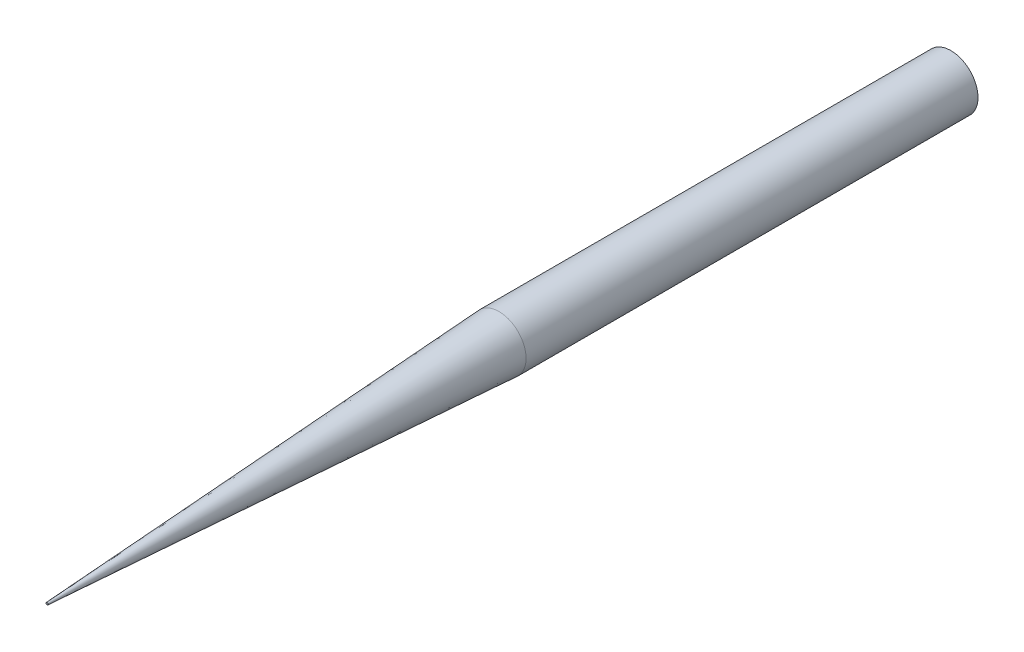
ISO-10303-21;
HEADER;
FILE_DESCRIPTION(('STEP AP214'),'2;1');
FILE_NAME('part.step','',(''),(''),'','','');
FILE_SCHEMA(('AUTOMOTIVE_DESIGN { 1 0 10303 214 1 1 1 1 }'));
ENDSEC;
DATA;
#1=APPLICATION_CONTEXT('core data for automotive mechanical design processes');
#2=APPLICATION_PROTOCOL_DEFINITION('international standard','automotive_design',2000,#1);
#3=PRODUCT_CONTEXT('',#1,'mechanical');
#4=PRODUCT('Part','Part','',(#3));
#5=PRODUCT_RELATED_PRODUCT_CATEGORY('part','',(#4));
#6=PRODUCT_DEFINITION_FORMATION('','',#4);
#7=PRODUCT_DEFINITION_CONTEXT('part definition',#1,'design');
#8=PRODUCT_DEFINITION('design','',#6,#7);
#9=PRODUCT_DEFINITION_SHAPE('','',#8);
#10=(LENGTH_UNIT() NAMED_UNIT(*) SI_UNIT(.MILLI.,.METRE.));
#11=(NAMED_UNIT(*) PLANE_ANGLE_UNIT() SI_UNIT($,.RADIAN.));
#12=(NAMED_UNIT(*) SI_UNIT($,.STERADIAN.) SOLID_ANGLE_UNIT());
#13=UNCERTAINTY_MEASURE_WITH_UNIT(LENGTH_MEASURE(1.E-05),#10,'distance_accuracy_value','');
#14=(GEOMETRIC_REPRESENTATION_CONTEXT(3) GLOBAL_UNCERTAINTY_ASSIGNED_CONTEXT((#13)) GLOBAL_UNIT_ASSIGNED_CONTEXT((#10,
#11,#12)) REPRESENTATION_CONTEXT('',''));
#15=CARTESIAN_POINT('',(0.,0.,0.));
#16=DIRECTION('',(0.,0.,1.));
#17=DIRECTION('',(1.,0.,0.));
#18=AXIS2_PLACEMENT_3D('',#15,#16,#17);
#19=CARTESIAN_POINT('',(0.,0.,50.));
#20=DIRECTION('',(0.,0.,-1.));
#21=DIRECTION('',(-1.,0.,0.));
#22=AXIS2_PLACEMENT_3D('',#19,#20,#21);
#23=CYLINDRICAL_SURFACE('',#22,1.5);
#24=CARTESIAN_POINT('',(0.,0.,24.9999999999968));
#25=DIRECTION('',(0.,0.,1.));
#26=DIRECTION('',(1.,0.,0.));
#27=AXIS2_PLACEMENT_3D('',#24,#25,#26);
#28=CIRCLE('',#27,1.5);
#29=CARTESIAN_POINT('',(1.5,0.,24.9999999999968));
#30=VERTEX_POINT('',#29);
#31=EDGE_CURVE('E10',#30,#30,#28,.F.);
#32=ORIENTED_EDGE('',*,*,#31,.T.);
#33=EDGE_LOOP('',(#32));
#34=FACE_BOUND('',#33,.T.);
#35=CARTESIAN_POINT('',(0.,0.,0.));
#36=DIRECTION('',(0.,0.,1.));
#37=DIRECTION('',(1.,0.,0.));
#38=AXIS2_PLACEMENT_3D('',#35,#36,#37);
#39=CIRCLE('',#38,1.5);
#40=CARTESIAN_POINT('',(1.5,0.,0.));
#41=VERTEX_POINT('',#40);
#42=EDGE_CURVE('E44',#41,#41,#39,.T.);
#43=ORIENTED_EDGE('',*,*,#42,.T.);
#44=EDGE_LOOP('',(#43));
#45=FACE_BOUND('',#44,.T.);
#46=ADVANCED_FACE('F33',(#34,#45),#23,.T.);
#47=CARTESIAN_POINT('',(0.,0.,50.));
#48=DIRECTION('',(0.,0.,1.));
#49=DIRECTION('',(1.,0.,0.));
#50=AXIS2_PLACEMENT_3D('',#47,#48,#49);
#51=PLANE('',#50);
#52=CARTESIAN_POINT('',(0.,0.,50.));
#53=DIRECTION('',(0.,0.,1.));
#54=DIRECTION('',(1.,0.,0.));
#55=AXIS2_PLACEMENT_3D('',#52,#53,#54);
#56=CIRCLE('',#55,0.0585090696990651);
#57=CARTESIAN_POINT('',(0.0585090696990651,0.,50.));
#58=VERTEX_POINT('',#57);
#59=EDGE_CURVE('E40',#58,#58,#56,.T.);
#60=ORIENTED_EDGE('',*,*,#59,.T.);
#61=EDGE_LOOP('',(#60));
#62=FACE_BOUND('',#61,.T.);
#63=ADVANCED_FACE('F54',(#62),#51,.T.);
#64=CARTESIAN_POINT('',(0.,0.,0.));
#65=DIRECTION('',(0.,0.,1.));
#66=DIRECTION('',(1.,0.,0.));
#67=AXIS2_PLACEMENT_3D('',#64,#65,#66);
#68=PLANE('',#67);
#69=ORIENTED_EDGE('',*,*,#42,.F.);
#70=EDGE_LOOP('',(#69));
#71=FACE_BOUND('',#70,.T.);
#72=ADVANCED_FACE('F52',(#71),#68,.F.);
#73=CARTESIAN_POINT('',(0.,0.,50.));
#74=DIRECTION('',(0.,0.,-1.));
#75=DIRECTION('',(-1.,0.,0.));
#76=AXIS2_PLACEMENT_3D('',#73,#74,#75);
#77=CONICAL_SURFACE('',#76,0.0585090696990651,0.0575958653158095);
#78=ORIENTED_EDGE('',*,*,#31,.F.);
#79=EDGE_LOOP('',(#78));
#80=FACE_BOUND('',#79,.T.);
#81=ORIENTED_EDGE('',*,*,#59,.F.);
#82=EDGE_LOOP('',(#81));
#83=FACE_BOUND('',#82,.T.);
#84=ADVANCED_FACE('F35',(#80,#83),#77,.T.);
#85=CLOSED_SHELL('',(#46,#63,#72,#84));
#86=MANIFOLD_SOLID_BREP('B2',#85);
#87=ADVANCED_BREP_SHAPE_REPRESENTATION('',(#18,#86),#14);
#88=SHAPE_DEFINITION_REPRESENTATION(#9,#87);
ENDSEC;
END-ISO-10303-21;
